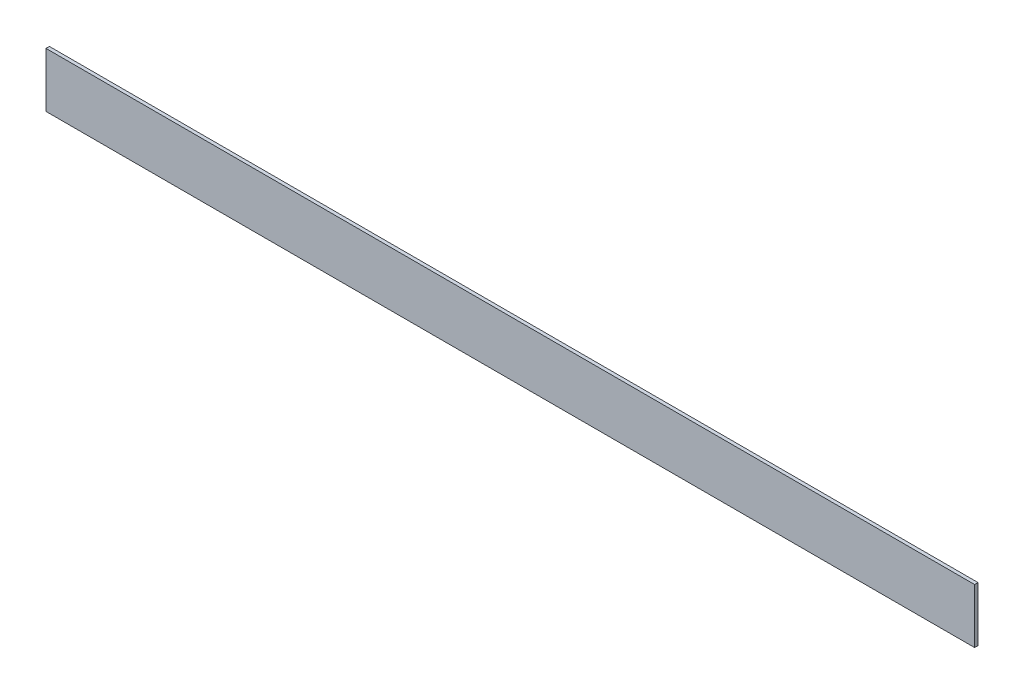
ISO-10303-21;
HEADER;
FILE_DESCRIPTION(('STEP AP214'),'2;1');
FILE_NAME('part.step','',(''),(''),'','','');
FILE_SCHEMA(('AUTOMOTIVE_DESIGN { 1 0 10303 214 1 1 1 1 }'));
ENDSEC;
DATA;
#1=APPLICATION_CONTEXT('core data for automotive mechanical design processes');
#2=APPLICATION_PROTOCOL_DEFINITION('international standard','automotive_design',2000,#1);
#3=PRODUCT_CONTEXT('',#1,'mechanical');
#4=PRODUCT('Part','Part','',(#3));
#5=PRODUCT_RELATED_PRODUCT_CATEGORY('part','',(#4));
#6=PRODUCT_DEFINITION_FORMATION('','',#4);
#7=PRODUCT_DEFINITION_CONTEXT('part definition',#1,'design');
#8=PRODUCT_DEFINITION('design','',#6,#7);
#9=PRODUCT_DEFINITION_SHAPE('','',#8);
#10=(LENGTH_UNIT() NAMED_UNIT(*) SI_UNIT(.MILLI.,.METRE.));
#11=(NAMED_UNIT(*) PLANE_ANGLE_UNIT() SI_UNIT($,.RADIAN.));
#12=(NAMED_UNIT(*) SI_UNIT($,.STERADIAN.) SOLID_ANGLE_UNIT());
#13=UNCERTAINTY_MEASURE_WITH_UNIT(LENGTH_MEASURE(1.E-05),#10,'distance_accuracy_value','');
#14=(GEOMETRIC_REPRESENTATION_CONTEXT(3) GLOBAL_UNCERTAINTY_ASSIGNED_CONTEXT((#13)) GLOBAL_UNIT_ASSIGNED_CONTEXT((#10,
#11,#12)) REPRESENTATION_CONTEXT('',''));
#15=CARTESIAN_POINT('',(0.,0.,0.));
#16=DIRECTION('',(0.,0.,1.));
#17=DIRECTION('',(1.,0.,0.));
#18=AXIS2_PLACEMENT_3D('',#15,#16,#17);
#19=CARTESIAN_POINT('',(0.,0.,3.175));
#20=DIRECTION('',(-1.,0.,0.));
#21=DIRECTION('',(0.,0.,1.));
#22=AXIS2_PLACEMENT_3D('',#19,#20,#21);
#23=PLANE('',#22);
#24=DIRECTION('',(0.,1.,0.));
#25=VECTOR('',#24,1.);
#26=CARTESIAN_POINT('',(0.,0.,0.));
#27=LINE('',#26,#25);
#28=CARTESIAN_POINT('',(0.,-50.8,0.));
#29=VERTEX_POINT('',#28);
#30=CARTESIAN_POINT('',(0.,0.,0.));
#31=VERTEX_POINT('',#30);
#32=EDGE_CURVE('E96',#29,#31,#27,.T.);
#33=ORIENTED_EDGE('',*,*,#32,.T.);
#34=DIRECTION('',(0.,0.,-1.));
#35=VECTOR('',#34,1.);
#36=CARTESIAN_POINT('',(0.,0.,3.175));
#37=LINE('',#36,#35);
#38=CARTESIAN_POINT('',(0.,0.,3.175));
#39=VERTEX_POINT('',#38);
#40=EDGE_CURVE('E11',#39,#31,#37,.T.);
#41=ORIENTED_EDGE('',*,*,#40,.F.);
#42=DIRECTION('',(0.,1.,0.));
#43=VECTOR('',#42,1.);
#44=CARTESIAN_POINT('',(0.,0.,3.175));
#45=LINE('',#44,#43);
#46=CARTESIAN_POINT('',(0.,-50.8,3.175));
#47=VERTEX_POINT('',#46);
#48=EDGE_CURVE('E84',#47,#39,#45,.T.);
#49=ORIENTED_EDGE('',*,*,#48,.F.);
#50=DIRECTION('',(0.,0.,-1.));
#51=VECTOR('',#50,1.);
#52=CARTESIAN_POINT('',(0.,-50.8,3.175));
#53=LINE('',#52,#51);
#54=EDGE_CURVE('E92',#47,#29,#53,.T.);
#55=ORIENTED_EDGE('',*,*,#54,.T.);
#56=EDGE_LOOP('',(#33,#41,#49,#55));
#57=FACE_BOUND('',#56,.T.);
#58=ADVANCED_FACE('F33',(#57),#23,.F.);
#59=CARTESIAN_POINT('',(0.,0.,3.175));
#60=DIRECTION('',(0.,-1.,0.));
#61=DIRECTION('',(1.,0.,0.));
#62=AXIS2_PLACEMENT_3D('',#59,#60,#61);
#63=PLANE('',#62);
#64=DIRECTION('',(-1.,0.,0.));
#65=VECTOR('',#64,1.);
#66=CARTESIAN_POINT('',(0.,0.,0.));
#67=LINE('',#66,#65);
#68=CARTESIAN_POINT('',(-863.6,-1.05760497574365E-13,0.));
#69=VERTEX_POINT('',#68);
#70=EDGE_CURVE('E88',#31,#69,#67,.T.);
#71=ORIENTED_EDGE('',*,*,#70,.T.);
#72=DIRECTION('',(0.,0.,-1.));
#73=VECTOR('',#72,1.);
#74=CARTESIAN_POINT('',(-863.6,-1.05760497574365E-13,3.175));
#75=LINE('',#74,#73);
#76=CARTESIAN_POINT('',(-863.6,-1.05760497574365E-13,3.175));
#77=VERTEX_POINT('',#76);
#78=EDGE_CURVE('E41',#77,#69,#75,.T.);
#79=ORIENTED_EDGE('',*,*,#78,.F.);
#80=DIRECTION('',(-1.,0.,0.));
#81=VECTOR('',#80,1.);
#82=CARTESIAN_POINT('',(0.,0.,3.175));
#83=LINE('',#82,#81);
#84=EDGE_CURVE('E79',#39,#77,#83,.T.);
#85=ORIENTED_EDGE('',*,*,#84,.F.);
#86=ORIENTED_EDGE('',*,*,#40,.T.);
#87=EDGE_LOOP('',(#71,#79,#85,#86));
#88=FACE_BOUND('',#87,.T.);
#89=ADVANCED_FACE('F87',(#88),#63,.F.);
#90=CARTESIAN_POINT('',(-863.6,-1.05760497574365E-13,3.175));
#91=DIRECTION('',(1.,0.,0.));
#92=DIRECTION('',(0.,0.,-1.));
#93=AXIS2_PLACEMENT_3D('',#90,#91,#92);
#94=PLANE('',#93);
#95=DIRECTION('',(0.,-1.,0.));
#96=VECTOR('',#95,1.);
#97=CARTESIAN_POINT('',(-863.6,-1.05760497574365E-13,0.));
#98=LINE('',#97,#96);
#99=CARTESIAN_POINT('',(-863.6,-50.8000000000001,0.));
#100=VERTEX_POINT('',#99);
#101=EDGE_CURVE('E66',#69,#100,#98,.T.);
#102=ORIENTED_EDGE('',*,*,#101,.T.);
#103=DIRECTION('',(0.,0.,-1.));
#104=VECTOR('',#103,1.);
#105=CARTESIAN_POINT('',(-863.6,-50.8000000000001,3.175));
#106=LINE('',#105,#104);
#107=CARTESIAN_POINT('',(-863.6,-50.8000000000001,3.175));
#108=VERTEX_POINT('',#107);
#109=EDGE_CURVE('E89',#108,#100,#106,.T.);
#110=ORIENTED_EDGE('',*,*,#109,.F.);
#111=DIRECTION('',(0.,-1.,0.));
#112=VECTOR('',#111,1.);
#113=CARTESIAN_POINT('',(-863.6,-1.05760497574365E-13,3.175));
#114=LINE('',#113,#112);
#115=EDGE_CURVE('E82',#77,#108,#114,.T.);
#116=ORIENTED_EDGE('',*,*,#115,.F.);
#117=ORIENTED_EDGE('',*,*,#78,.T.);
#118=EDGE_LOOP('',(#102,#110,#116,#117));
#119=FACE_BOUND('',#118,.T.);
#120=ADVANCED_FACE('F90',(#119),#94,.F.);
#121=CARTESIAN_POINT('',(0.,-50.8,3.175));
#122=DIRECTION('',(0.,1.,0.));
#123=DIRECTION('',(-1.,0.,0.));
#124=AXIS2_PLACEMENT_3D('',#121,#122,#123);
#125=PLANE('',#124);
#126=DIRECTION('',(1.,0.,0.));
#127=VECTOR('',#126,1.);
#128=CARTESIAN_POINT('',(0.,-50.8,0.));
#129=LINE('',#128,#127);
#130=EDGE_CURVE('E72',#100,#29,#129,.T.);
#131=ORIENTED_EDGE('',*,*,#130,.T.);
#132=ORIENTED_EDGE('',*,*,#54,.F.);
#133=DIRECTION('',(1.,0.,0.));
#134=VECTOR('',#133,1.);
#135=CARTESIAN_POINT('',(0.,-50.8,3.175));
#136=LINE('',#135,#134);
#137=EDGE_CURVE('E49',#108,#47,#136,.T.);
#138=ORIENTED_EDGE('',*,*,#137,.F.);
#139=ORIENTED_EDGE('',*,*,#109,.T.);
#140=EDGE_LOOP('',(#131,#132,#138,#139));
#141=FACE_BOUND('',#140,.T.);
#142=ADVANCED_FACE('F103',(#141),#125,.F.);
#143=CARTESIAN_POINT('',(0.,0.,3.175));
#144=DIRECTION('',(0.,0.,-1.));
#145=DIRECTION('',(-1.,0.,0.));
#146=AXIS2_PLACEMENT_3D('',#143,#144,#145);
#147=PLANE('',#146);
#148=ORIENTED_EDGE('',*,*,#48,.T.);
#149=ORIENTED_EDGE('',*,*,#84,.T.);
#150=ORIENTED_EDGE('',*,*,#115,.T.);
#151=ORIENTED_EDGE('',*,*,#137,.T.);
#152=EDGE_LOOP('',(#148,#149,#150,#151));
#153=FACE_BOUND('',#152,.T.);
#154=ADVANCED_FACE('F80',(#153),#147,.F.);
#155=CARTESIAN_POINT('',(0.,0.,0.));
#156=DIRECTION('',(0.,0.,-1.));
#157=DIRECTION('',(-1.,0.,0.));
#158=AXIS2_PLACEMENT_3D('',#155,#156,#157);
#159=PLANE('',#158);
#160=ORIENTED_EDGE('',*,*,#32,.F.);
#161=ORIENTED_EDGE('',*,*,#130,.F.);
#162=ORIENTED_EDGE('',*,*,#101,.F.);
#163=ORIENTED_EDGE('',*,*,#70,.F.);
#164=EDGE_LOOP('',(#160,#161,#162,#163));
#165=FACE_BOUND('',#164,.T.);
#166=ADVANCED_FACE('F106',(#165),#159,.T.);
#167=CLOSED_SHELL('',(#58,#89,#120,#142,#154,#166));
#168=MANIFOLD_SOLID_BREP('B2',#167);
#169=ADVANCED_BREP_SHAPE_REPRESENTATION('',(#18,#168),#14);
#170=SHAPE_DEFINITION_REPRESENTATION(#9,#169);
ENDSEC;
END-ISO-10303-21;
